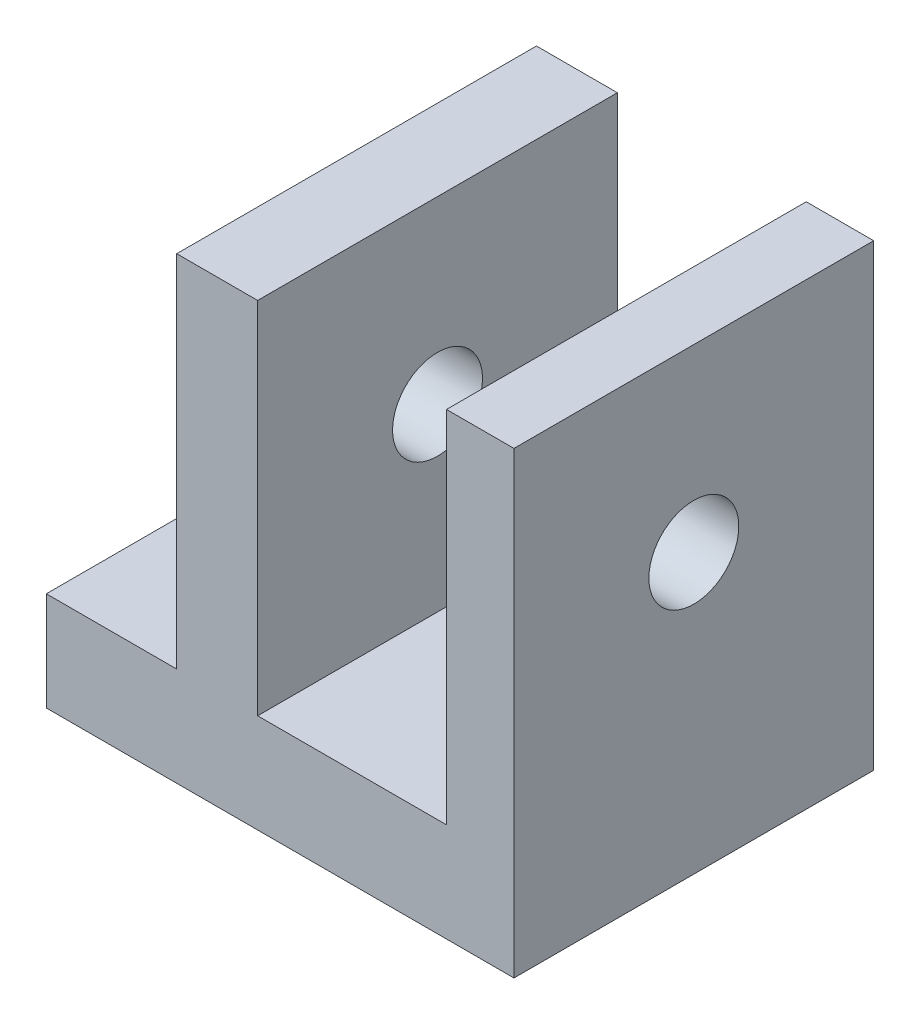
ISO-10303-21;
HEADER;
FILE_DESCRIPTION(('STEP AP214'),'2;1');
FILE_NAME('part.step','',(''),(''),'','','');
FILE_SCHEMA(('AUTOMOTIVE_DESIGN { 1 0 10303 214 1 1 1 1 }'));
ENDSEC;
DATA;
#1=APPLICATION_CONTEXT('core data for automotive mechanical design processes');
#2=APPLICATION_PROTOCOL_DEFINITION('international standard','automotive_design',2000,#1);
#3=PRODUCT_CONTEXT('',#1,'mechanical');
#4=PRODUCT('Part','Part','',(#3));
#5=PRODUCT_RELATED_PRODUCT_CATEGORY('part','',(#4));
#6=PRODUCT_DEFINITION_FORMATION('','',#4);
#7=PRODUCT_DEFINITION_CONTEXT('part definition',#1,'design');
#8=PRODUCT_DEFINITION('design','',#6,#7);
#9=PRODUCT_DEFINITION_SHAPE('','',#8);
#10=(LENGTH_UNIT() NAMED_UNIT(*) SI_UNIT(.MILLI.,.METRE.));
#11=(NAMED_UNIT(*) PLANE_ANGLE_UNIT() SI_UNIT($,.RADIAN.));
#12=(NAMED_UNIT(*) SI_UNIT($,.STERADIAN.) SOLID_ANGLE_UNIT());
#13=UNCERTAINTY_MEASURE_WITH_UNIT(LENGTH_MEASURE(1.E-05),#10,'distance_accuracy_value','');
#14=(GEOMETRIC_REPRESENTATION_CONTEXT(3) GLOBAL_UNCERTAINTY_ASSIGNED_CONTEXT((#13)) GLOBAL_UNIT_ASSIGNED_CONTEXT((#10,
#11,#12)) REPRESENTATION_CONTEXT('',''));
#15=CARTESIAN_POINT('',(0.,0.,0.));
#16=DIRECTION('',(0.,0.,1.));
#17=DIRECTION('',(1.,0.,0.));
#18=AXIS2_PLACEMENT_3D('',#15,#16,#17);
#19=CARTESIAN_POINT('',(0.,0.,-10.));
#20=DIRECTION('',(0.,0.,1.));
#21=DIRECTION('',(1.,0.,0.));
#22=AXIS2_PLACEMENT_3D('',#19,#20,#21);
#23=PLANE('',#22);
#24=DIRECTION('',(-1.,0.,0.));
#25=VECTOR('',#24,1.);
#26=CARTESIAN_POINT('',(0.,24.25,-10.));
#27=LINE('',#26,#25);
#28=CARTESIAN_POINT('',(13.,24.25,-10.));
#29=VERTEX_POINT('',#28);
#30=CARTESIAN_POINT('',(9.25,24.25,-10.));
#31=VERTEX_POINT('',#30);
#32=EDGE_CURVE('E506',#29,#31,#27,.T.);
#33=ORIENTED_EDGE('',*,*,#32,.F.);
#34=DIRECTION('',(0.,1.,0.));
#35=VECTOR('',#34,1.);
#36=CARTESIAN_POINT('',(13.,0.,-10.));
#37=LINE('',#36,#35);
#38=CARTESIAN_POINT('',(13.,-1.25,-10.));
#39=VERTEX_POINT('',#38);
#40=EDGE_CURVE('E452',#39,#29,#37,.T.);
#41=ORIENTED_EDGE('',*,*,#40,.F.);
#42=DIRECTION('',(1.,0.,0.));
#43=VECTOR('',#42,1.);
#44=CARTESIAN_POINT('',(0.,-1.25,-10.));
#45=LINE('',#44,#43);
#46=CARTESIAN_POINT('',(-13.,-1.25,-10.));
#47=VERTEX_POINT('',#46);
#48=EDGE_CURVE('E446',#47,#39,#45,.T.);
#49=ORIENTED_EDGE('',*,*,#48,.F.);
#50=DIRECTION('',(0.,1.,0.));
#51=VECTOR('',#50,1.);
#52=CARTESIAN_POINT('',(-13.,0.,-10.));
#53=LINE('',#52,#51);
#54=CARTESIAN_POINT('',(-13.,4.25,-10.));
#55=VERTEX_POINT('',#54);
#56=EDGE_CURVE('E487',#47,#55,#53,.T.);
#57=ORIENTED_EDGE('',*,*,#56,.T.);
#58=DIRECTION('',(1.,0.,0.));
#59=VECTOR('',#58,1.);
#60=CARTESIAN_POINT('',(0.,4.25,-10.));
#61=LINE('',#60,#59);
#62=CARTESIAN_POINT('',(-5.75,4.25,-10.));
#63=VERTEX_POINT('',#62);
#64=EDGE_CURVE('E525',#55,#63,#61,.T.);
#65=ORIENTED_EDGE('',*,*,#64,.T.);
#66=DIRECTION('',(0.,1.,0.));
#67=VECTOR('',#66,1.);
#68=CARTESIAN_POINT('',(-5.75,0.,-10.));
#69=LINE('',#68,#67);
#70=CARTESIAN_POINT('',(-5.75,24.25,-10.));
#71=VERTEX_POINT('',#70);
#72=EDGE_CURVE('E522',#63,#71,#69,.T.);
#73=ORIENTED_EDGE('',*,*,#72,.T.);
#74=DIRECTION('',(1.,0.,0.));
#75=VECTOR('',#74,1.);
#76=CARTESIAN_POINT('',(0.,24.25,-10.));
#77=LINE('',#76,#75);
#78=CARTESIAN_POINT('',(-1.25,24.25,-10.));
#79=VERTEX_POINT('',#78);
#80=EDGE_CURVE('E519',#71,#79,#77,.T.);
#81=ORIENTED_EDGE('',*,*,#80,.T.);
#82=DIRECTION('',(0.,-1.,0.));
#83=VECTOR('',#82,1.);
#84=CARTESIAN_POINT('',(-1.24999999999999,0.,-10.));
#85=LINE('',#84,#83);
#86=CARTESIAN_POINT('',(-1.25,4.25,-10.));
#87=VERTEX_POINT('',#86);
#88=EDGE_CURVE('E516',#79,#87,#85,.T.);
#89=ORIENTED_EDGE('',*,*,#88,.T.);
#90=DIRECTION('',(1.,0.,0.));
#91=VECTOR('',#90,1.);
#92=CARTESIAN_POINT('',(0.,4.25,-10.));
#93=LINE('',#92,#91);
#94=CARTESIAN_POINT('',(9.25000000000001,4.25,-10.));
#95=VERTEX_POINT('',#94);
#96=EDGE_CURVE('E513',#87,#95,#93,.T.);
#97=ORIENTED_EDGE('',*,*,#96,.T.);
#98=DIRECTION('',(0.,-1.,0.));
#99=VECTOR('',#98,1.);
#100=CARTESIAN_POINT('',(9.25000000000001,0.,-10.));
#101=LINE('',#100,#99);
#102=EDGE_CURVE('E509',#31,#95,#101,.T.);
#103=ORIENTED_EDGE('',*,*,#102,.F.);
#104=EDGE_LOOP('',(#33,#41,#49,#57,#65,#73,#81,#89,#97,#103));
#105=FACE_BOUND('',#104,.T.);
#106=ADVANCED_FACE('F395',(#105),#23,.F.);
#107=CARTESIAN_POINT('',(9.25000000000001,0.,10.));
#108=DIRECTION('',(1.,0.,0.));
#109=DIRECTION('',(0.,1.,0.));
#110=AXIS2_PLACEMENT_3D('',#107,#108,#109);
#111=PLANE('',#110);
#112=CARTESIAN_POINT('',(9.25,14.25,0.));
#113=DIRECTION('',(1.,0.,0.));
#114=DIRECTION('',(0.,1.,0.));
#115=AXIS2_PLACEMENT_3D('',#112,#113,#114);
#116=CIRCLE('',#115,2.5);
#117=CARTESIAN_POINT('',(9.25,14.25,2.5));
#118=VERTEX_POINT('',#117);
#119=EDGE_CURVE('E717',#118,#118,#116,.T.);
#120=ORIENTED_EDGE('',*,*,#119,.T.);
#121=EDGE_LOOP('',(#120));
#122=FACE_BOUND('',#121,.T.);
#123=ORIENTED_EDGE('',*,*,#102,.T.);
#124=DIRECTION('',(0.,0.,-1.));
#125=VECTOR('',#124,1.);
#126=CARTESIAN_POINT('',(9.25000000000001,4.25,10.));
#127=LINE('',#126,#125);
#128=CARTESIAN_POINT('',(9.25000000000001,4.25,10.));
#129=VERTEX_POINT('',#128);
#130=EDGE_CURVE('E404',#129,#95,#127,.T.);
#131=ORIENTED_EDGE('',*,*,#130,.F.);
#132=DIRECTION('',(0.,-1.,0.));
#133=VECTOR('',#132,1.);
#134=CARTESIAN_POINT('',(9.25000000000001,0.,10.));
#135=LINE('',#134,#133);
#136=CARTESIAN_POINT('',(9.25,24.25,10.));
#137=VERTEX_POINT('',#136);
#138=EDGE_CURVE('E460',#137,#129,#135,.T.);
#139=ORIENTED_EDGE('',*,*,#138,.F.);
#140=DIRECTION('',(0.,0.,-1.));
#141=VECTOR('',#140,1.);
#142=CARTESIAN_POINT('',(9.25,24.25,10.));
#143=LINE('',#142,#141);
#144=EDGE_CURVE('E12',#137,#31,#143,.T.);
#145=ORIENTED_EDGE('',*,*,#144,.T.);
#146=EDGE_LOOP('',(#123,#131,#139,#145));
#147=FACE_BOUND('',#146,.T.);
#148=ADVANCED_FACE('F548',(#122,#147),#111,.F.);
#149=CARTESIAN_POINT('',(0.,4.25,10.));
#150=DIRECTION('',(0.,1.,0.));
#151=DIRECTION('',(-1.,0.,0.));
#152=AXIS2_PLACEMENT_3D('',#149,#150,#151);
#153=PLANE('',#152);
#154=ORIENTED_EDGE('',*,*,#96,.F.);
#155=DIRECTION('',(0.,0.,-1.));
#156=VECTOR('',#155,1.);
#157=CARTESIAN_POINT('',(-1.25,4.25,10.));
#158=LINE('',#157,#156);
#159=CARTESIAN_POINT('',(-1.25,4.25,10.));
#160=VERTEX_POINT('',#159);
#161=EDGE_CURVE('E541',#160,#87,#158,.T.);
#162=ORIENTED_EDGE('',*,*,#161,.F.);
#163=DIRECTION('',(1.,0.,0.));
#164=VECTOR('',#163,1.);
#165=CARTESIAN_POINT('',(0.,4.25,10.));
#166=LINE('',#165,#164);
#167=EDGE_CURVE('E547',#160,#129,#166,.T.);
#168=ORIENTED_EDGE('',*,*,#167,.T.);
#169=ORIENTED_EDGE('',*,*,#130,.T.);
#170=EDGE_LOOP('',(#154,#162,#168,#169));
#171=FACE_BOUND('',#170,.T.);
#172=ADVANCED_FACE('F545',(#171),#153,.T.);
#173=CARTESIAN_POINT('',(-1.24999999999999,0.,10.));
#174=DIRECTION('',(1.,0.,0.));
#175=DIRECTION('',(0.,1.,0.));
#176=AXIS2_PLACEMENT_3D('',#173,#174,#175);
#177=PLANE('',#176);
#178=CARTESIAN_POINT('',(-1.25,14.25,0.));
#179=DIRECTION('',(1.,0.,0.));
#180=DIRECTION('',(0.,1.,0.));
#181=AXIS2_PLACEMENT_3D('',#178,#179,#180);
#182=CIRCLE('',#181,2.5);
#183=CARTESIAN_POINT('',(-1.25,14.25,2.5));
#184=VERTEX_POINT('',#183);
#185=EDGE_CURVE('E707',#184,#184,#182,.T.);
#186=ORIENTED_EDGE('',*,*,#185,.F.);
#187=EDGE_LOOP('',(#186));
#188=FACE_BOUND('',#187,.T.);
#189=ORIENTED_EDGE('',*,*,#88,.F.);
#190=DIRECTION('',(0.,0.,-1.));
#191=VECTOR('',#190,1.);
#192=CARTESIAN_POINT('',(-1.25,24.25,10.));
#193=LINE('',#192,#191);
#194=CARTESIAN_POINT('',(-1.25,24.25,10.));
#195=VERTEX_POINT('',#194);
#196=EDGE_CURVE('E539',#195,#79,#193,.T.);
#197=ORIENTED_EDGE('',*,*,#196,.F.);
#198=DIRECTION('',(0.,-1.,0.));
#199=VECTOR('',#198,1.);
#200=CARTESIAN_POINT('',(-1.24999999999999,0.,10.));
#201=LINE('',#200,#199);
#202=EDGE_CURVE('E558',#195,#160,#201,.T.);
#203=ORIENTED_EDGE('',*,*,#202,.T.);
#204=ORIENTED_EDGE('',*,*,#161,.T.);
#205=EDGE_LOOP('',(#189,#197,#203,#204));
#206=FACE_BOUND('',#205,.T.);
#207=ADVANCED_FACE('F555',(#188,#206),#177,.T.);
#208=CARTESIAN_POINT('',(0.,24.25,10.));
#209=DIRECTION('',(0.,1.,0.));
#210=DIRECTION('',(0.,0.,1.));
#211=AXIS2_PLACEMENT_3D('',#208,#209,#210);
#212=PLANE('',#211);
#213=ORIENTED_EDGE('',*,*,#80,.F.);
#214=DIRECTION('',(0.,0.,-1.));
#215=VECTOR('',#214,1.);
#216=CARTESIAN_POINT('',(-5.75,24.25,10.));
#217=LINE('',#216,#215);
#218=CARTESIAN_POINT('',(-5.75,24.25,10.));
#219=VERTEX_POINT('',#218);
#220=EDGE_CURVE('E537',#219,#71,#217,.T.);
#221=ORIENTED_EDGE('',*,*,#220,.F.);
#222=DIRECTION('',(1.,0.,0.));
#223=VECTOR('',#222,1.);
#224=CARTESIAN_POINT('',(0.,24.25,10.));
#225=LINE('',#224,#223);
#226=EDGE_CURVE('E562',#219,#195,#225,.T.);
#227=ORIENTED_EDGE('',*,*,#226,.T.);
#228=ORIENTED_EDGE('',*,*,#196,.T.);
#229=EDGE_LOOP('',(#213,#221,#227,#228));
#230=FACE_BOUND('',#229,.T.);
#231=ADVANCED_FACE('F610',(#230),#212,.T.);
#232=CARTESIAN_POINT('',(-5.75,0.,10.));
#233=DIRECTION('',(-1.,0.,0.));
#234=DIRECTION('',(0.,0.,1.));
#235=AXIS2_PLACEMENT_3D('',#232,#233,#234);
#236=PLANE('',#235);
#237=CARTESIAN_POINT('',(-5.75,14.25,0.));
#238=DIRECTION('',(-1.,0.,0.));
#239=DIRECTION('',(0.,0.,1.));
#240=AXIS2_PLACEMENT_3D('',#237,#238,#239);
#241=CIRCLE('',#240,2.5);
#242=CARTESIAN_POINT('',(-5.74999999999999,14.25,2.5));
#243=VERTEX_POINT('',#242);
#244=EDGE_CURVE('E710',#243,#243,#241,.T.);
#245=ORIENTED_EDGE('',*,*,#244,.F.);
#246=EDGE_LOOP('',(#245));
#247=FACE_BOUND('',#246,.T.);
#248=ORIENTED_EDGE('',*,*,#72,.F.);
#249=DIRECTION('',(0.,0.,-1.));
#250=VECTOR('',#249,1.);
#251=CARTESIAN_POINT('',(-5.75,4.25,10.));
#252=LINE('',#251,#250);
#253=CARTESIAN_POINT('',(-5.75,4.25,10.));
#254=VERTEX_POINT('',#253);
#255=EDGE_CURVE('E535',#254,#63,#252,.T.);
#256=ORIENTED_EDGE('',*,*,#255,.F.);
#257=DIRECTION('',(0.,1.,0.));
#258=VECTOR('',#257,1.);
#259=CARTESIAN_POINT('',(-5.75,0.,10.));
#260=LINE('',#259,#258);
#261=EDGE_CURVE('E500',#254,#219,#260,.T.);
#262=ORIENTED_EDGE('',*,*,#261,.T.);
#263=ORIENTED_EDGE('',*,*,#220,.T.);
#264=EDGE_LOOP('',(#248,#256,#262,#263));
#265=FACE_BOUND('',#264,.T.);
#266=ADVANCED_FACE('F570',(#247,#265),#236,.T.);
#267=CARTESIAN_POINT('',(0.,4.25,10.));
#268=DIRECTION('',(0.,1.,0.));
#269=DIRECTION('',(-1.,0.,0.));
#270=AXIS2_PLACEMENT_3D('',#267,#268,#269);
#271=PLANE('',#270);
#272=CARTESIAN_POINT('',(-9.,4.25,3.));
#273=DIRECTION('',(0.,1.,0.));
#274=DIRECTION('',(-1.,0.,0.));
#275=AXIS2_PLACEMENT_3D('',#272,#273,#274);
#276=CIRCLE('',#275,1.69999999999999);
#277=CARTESIAN_POINT('',(-10.7,4.25,3.));
#278=VERTEX_POINT('',#277);
#279=EDGE_CURVE('E722',#278,#278,#276,.T.);
#280=ORIENTED_EDGE('',*,*,#279,.F.);
#281=EDGE_LOOP('',(#280));
#282=FACE_BOUND('',#281,.T.);
#283=CARTESIAN_POINT('',(-9.,4.25,-3.));
#284=DIRECTION('',(0.,1.,0.));
#285=DIRECTION('',(-1.,0.,0.));
#286=AXIS2_PLACEMENT_3D('',#283,#284,#285);
#287=CIRCLE('',#286,1.69999999999999);
#288=CARTESIAN_POINT('',(-10.7,4.25,-3.));
#289=VERTEX_POINT('',#288);
#290=EDGE_CURVE('E510',#289,#289,#287,.T.);
#291=ORIENTED_EDGE('',*,*,#290,.F.);
#292=EDGE_LOOP('',(#291));
#293=FACE_BOUND('',#292,.T.);
#294=ORIENTED_EDGE('',*,*,#64,.F.);
#295=DIRECTION('',(0.,0.,-1.));
#296=VECTOR('',#295,1.);
#297=CARTESIAN_POINT('',(-13.,4.25,10.));
#298=LINE('',#297,#296);
#299=CARTESIAN_POINT('',(-13.,4.25,10.));
#300=VERTEX_POINT('',#299);
#301=EDGE_CURVE('E488',#300,#55,#298,.T.);
#302=ORIENTED_EDGE('',*,*,#301,.F.);
#303=DIRECTION('',(1.,0.,0.));
#304=VECTOR('',#303,1.);
#305=CARTESIAN_POINT('',(0.,4.25,10.));
#306=LINE('',#305,#304);
#307=EDGE_CURVE('E498',#300,#254,#306,.T.);
#308=ORIENTED_EDGE('',*,*,#307,.T.);
#309=ORIENTED_EDGE('',*,*,#255,.T.);
#310=EDGE_LOOP('',(#294,#302,#308,#309));
#311=FACE_BOUND('',#310,.T.);
#312=ADVANCED_FACE('F573',(#282,#293,#311),#271,.T.);
#313=CARTESIAN_POINT('',(-13.,0.,10.));
#314=DIRECTION('',(-1.,0.,0.));
#315=DIRECTION('',(0.,-1.,0.));
#316=AXIS2_PLACEMENT_3D('',#313,#314,#315);
#317=PLANE('',#316);
#318=ORIENTED_EDGE('',*,*,#56,.F.);
#319=DIRECTION('',(0.,0.,-1.));
#320=VECTOR('',#319,1.);
#321=CARTESIAN_POINT('',(-13.,-1.25,10.));
#322=LINE('',#321,#320);
#323=CARTESIAN_POINT('',(-13.,-1.25,10.));
#324=VERTEX_POINT('',#323);
#325=EDGE_CURVE('E481',#324,#47,#322,.T.);
#326=ORIENTED_EDGE('',*,*,#325,.F.);
#327=DIRECTION('',(0.,1.,0.));
#328=VECTOR('',#327,1.);
#329=CARTESIAN_POINT('',(-13.,0.,10.));
#330=LINE('',#329,#328);
#331=EDGE_CURVE('E485',#324,#300,#330,.T.);
#332=ORIENTED_EDGE('',*,*,#331,.T.);
#333=ORIENTED_EDGE('',*,*,#301,.T.);
#334=EDGE_LOOP('',(#318,#326,#332,#333));
#335=FACE_BOUND('',#334,.T.);
#336=ADVANCED_FACE('F483',(#335),#317,.T.);
#337=CARTESIAN_POINT('',(0.,-1.25,10.));
#338=DIRECTION('',(0.,1.,0.));
#339=DIRECTION('',(0.,0.,1.));
#340=AXIS2_PLACEMENT_3D('',#337,#338,#339);
#341=PLANE('',#340);
#342=CARTESIAN_POINT('',(-9.,-1.25,3.));
#343=DIRECTION('',(0.,-1.,0.));
#344=DIRECTION('',(0.,0.,-1.));
#345=AXIS2_PLACEMENT_3D('',#342,#343,#344);
#346=CIRCLE('',#345,1.69999999999999);
#347=CARTESIAN_POINT('',(-9.,-1.25,1.30000000000001));
#348=VERTEX_POINT('',#347);
#349=EDGE_CURVE('E719',#348,#348,#346,.T.);
#350=ORIENTED_EDGE('',*,*,#349,.F.);
#351=EDGE_LOOP('',(#350));
#352=FACE_BOUND('',#351,.T.);
#353=CARTESIAN_POINT('',(-9.,-1.25,-3.));
#354=DIRECTION('',(0.,-1.,0.));
#355=DIRECTION('',(0.,0.,-1.));
#356=AXIS2_PLACEMENT_3D('',#353,#354,#355);
#357=CIRCLE('',#356,1.69999999999999);
#358=CARTESIAN_POINT('',(-9.,-1.25,-4.69999999999999));
#359=VERTEX_POINT('',#358);
#360=EDGE_CURVE('E725',#359,#359,#357,.T.);
#361=ORIENTED_EDGE('',*,*,#360,.F.);
#362=EDGE_LOOP('',(#361));
#363=FACE_BOUND('',#362,.T.);
#364=ORIENTED_EDGE('',*,*,#48,.T.);
#365=DIRECTION('',(0.,0.,-1.));
#366=VECTOR('',#365,1.);
#367=CARTESIAN_POINT('',(13.,-1.25,10.));
#368=LINE('',#367,#366);
#369=CARTESIAN_POINT('',(13.,-1.25,10.));
#370=VERTEX_POINT('',#369);
#371=EDGE_CURVE('E489',#370,#39,#368,.T.);
#372=ORIENTED_EDGE('',*,*,#371,.F.);
#373=DIRECTION('',(1.,0.,0.));
#374=VECTOR('',#373,1.);
#375=CARTESIAN_POINT('',(0.,-1.25,10.));
#376=LINE('',#375,#374);
#377=EDGE_CURVE('E491',#324,#370,#376,.T.);
#378=ORIENTED_EDGE('',*,*,#377,.F.);
#379=ORIENTED_EDGE('',*,*,#325,.T.);
#380=EDGE_LOOP('',(#364,#372,#378,#379));
#381=FACE_BOUND('',#380,.T.);
#382=ADVANCED_FACE('F492',(#352,#363,#381),#341,.F.);
#383=CARTESIAN_POINT('',(13.,0.,10.));
#384=DIRECTION('',(-1.,0.,0.));
#385=DIRECTION('',(0.,0.,1.));
#386=AXIS2_PLACEMENT_3D('',#383,#384,#385);
#387=PLANE('',#386);
#388=CARTESIAN_POINT('',(13.,14.25,0.));
#389=DIRECTION('',(-1.,0.,0.));
#390=DIRECTION('',(0.,0.,1.));
#391=AXIS2_PLACEMENT_3D('',#388,#389,#390);
#392=CIRCLE('',#391,2.5);
#393=CARTESIAN_POINT('',(13.,14.25,2.5));
#394=VERTEX_POINT('',#393);
#395=EDGE_CURVE('E711',#394,#394,#392,.F.);
#396=ORIENTED_EDGE('',*,*,#395,.F.);
#397=EDGE_LOOP('',(#396));
#398=FACE_BOUND('',#397,.T.);
#399=ORIENTED_EDGE('',*,*,#40,.T.);
#400=DIRECTION('',(0.,0.,-1.));
#401=VECTOR('',#400,1.);
#402=CARTESIAN_POINT('',(13.,24.25,10.));
#403=LINE('',#402,#401);
#404=CARTESIAN_POINT('',(13.,24.25,10.));
#405=VERTEX_POINT('',#404);
#406=EDGE_CURVE('E505',#405,#29,#403,.T.);
#407=ORIENTED_EDGE('',*,*,#406,.F.);
#408=DIRECTION('',(0.,1.,0.));
#409=VECTOR('',#408,1.);
#410=CARTESIAN_POINT('',(13.,0.,10.));
#411=LINE('',#410,#409);
#412=EDGE_CURVE('E412',#370,#405,#411,.T.);
#413=ORIENTED_EDGE('',*,*,#412,.F.);
#414=ORIENTED_EDGE('',*,*,#371,.T.);
#415=EDGE_LOOP('',(#399,#407,#413,#414));
#416=FACE_BOUND('',#415,.T.);
#417=ADVANCED_FACE('F576',(#398,#416),#387,.F.);
#418=CARTESIAN_POINT('',(0.,24.25,10.));
#419=DIRECTION('',(0.,-1.,0.));
#420=DIRECTION('',(0.,0.,-1.));
#421=AXIS2_PLACEMENT_3D('',#418,#419,#420);
#422=PLANE('',#421);
#423=ORIENTED_EDGE('',*,*,#32,.T.);
#424=ORIENTED_EDGE('',*,*,#144,.F.);
#425=DIRECTION('',(-1.,0.,0.));
#426=VECTOR('',#425,1.);
#427=CARTESIAN_POINT('',(0.,24.25,10.));
#428=LINE('',#427,#426);
#429=EDGE_CURVE('E531',#405,#137,#428,.T.);
#430=ORIENTED_EDGE('',*,*,#429,.F.);
#431=ORIENTED_EDGE('',*,*,#406,.T.);
#432=EDGE_LOOP('',(#423,#424,#430,#431));
#433=FACE_BOUND('',#432,.T.);
#434=ADVANCED_FACE('F397',(#433),#422,.F.);
#435=CARTESIAN_POINT('',(0.,0.,10.));
#436=DIRECTION('',(0.,0.,1.));
#437=DIRECTION('',(1.,0.,0.));
#438=AXIS2_PLACEMENT_3D('',#435,#436,#437);
#439=PLANE('',#438);
#440=ORIENTED_EDGE('',*,*,#429,.T.);
#441=ORIENTED_EDGE('',*,*,#138,.T.);
#442=ORIENTED_EDGE('',*,*,#167,.F.);
#443=ORIENTED_EDGE('',*,*,#202,.F.);
#444=ORIENTED_EDGE('',*,*,#226,.F.);
#445=ORIENTED_EDGE('',*,*,#261,.F.);
#446=ORIENTED_EDGE('',*,*,#307,.F.);
#447=ORIENTED_EDGE('',*,*,#331,.F.);
#448=ORIENTED_EDGE('',*,*,#377,.T.);
#449=ORIENTED_EDGE('',*,*,#412,.T.);
#450=EDGE_LOOP('',(#440,#441,#442,#443,#444,#445,#446,#447,#448,#449));
#451=FACE_BOUND('',#450,.T.);
#452=ADVANCED_FACE('F495',(#451),#439,.T.);
#453=CARTESIAN_POINT('',(-9.,-1.25,-3.));
#454=DIRECTION('',(0.,-1.,0.));
#455=DIRECTION('',(0.,0.,-1.));
#456=AXIS2_PLACEMENT_3D('',#453,#454,#455);
#457=CYLINDRICAL_SURFACE('',#456,1.69999999999999);
#458=ORIENTED_EDGE('',*,*,#290,.T.);
#459=EDGE_LOOP('',(#458));
#460=FACE_BOUND('',#459,.T.);
#461=ORIENTED_EDGE('',*,*,#360,.T.);
#462=EDGE_LOOP('',(#461));
#463=FACE_BOUND('',#462,.T.);
#464=ADVANCED_FACE('F584',(#460,#463),#457,.F.);
#465=CARTESIAN_POINT('',(-9.,-1.25,3.));
#466=DIRECTION('',(0.,-1.,0.));
#467=DIRECTION('',(0.,0.,-1.));
#468=AXIS2_PLACEMENT_3D('',#465,#466,#467);
#469=CYLINDRICAL_SURFACE('',#468,1.69999999999999);
#470=ORIENTED_EDGE('',*,*,#279,.T.);
#471=EDGE_LOOP('',(#470));
#472=FACE_BOUND('',#471,.T.);
#473=ORIENTED_EDGE('',*,*,#349,.T.);
#474=EDGE_LOOP('',(#473));
#475=FACE_BOUND('',#474,.T.);
#476=ADVANCED_FACE('F594',(#472,#475),#469,.F.);
#477=CARTESIAN_POINT('',(20.0710678118655,14.25,0.));
#478=DIRECTION('',(-1.,0.,0.));
#479=DIRECTION('',(0.,0.,1.));
#480=AXIS2_PLACEMENT_3D('',#477,#478,#479);
#481=CYLINDRICAL_SURFACE('',#480,2.5);
#482=CARTESIAN_POINT('',(13.,14.25,2.5));
#483=CARTESIAN_POINT('',(12.9609375,14.25,2.5));
#484=CARTESIAN_POINT('',(12.921875,14.25,2.5));
#485=CARTESIAN_POINT('',(12.84375,14.25,2.5));
#486=CARTESIAN_POINT('',(12.8046875,14.25,2.5));
#487=CARTESIAN_POINT('',(12.7265625,14.25,2.5));
#488=CARTESIAN_POINT('',(12.6875,14.25,2.5));
#489=CARTESIAN_POINT('',(12.609375,14.25,2.5));
#490=CARTESIAN_POINT('',(12.5703125,14.25,2.5));
#491=CARTESIAN_POINT('',(12.4921875,14.25,2.5));
#492=CARTESIAN_POINT('',(12.453125,14.25,2.5));
#493=CARTESIAN_POINT('',(12.375,14.25,2.5));
#494=CARTESIAN_POINT('',(12.3359375,14.25,2.5));
#495=CARTESIAN_POINT('',(12.2578125,14.25,2.5));
#496=CARTESIAN_POINT('',(12.21875,14.25,2.5));
#497=CARTESIAN_POINT('',(12.140625,14.25,2.5));
#498=CARTESIAN_POINT('',(12.1015625,14.25,2.5));
#499=CARTESIAN_POINT('',(12.0234375,14.25,2.5));
#500=CARTESIAN_POINT('',(11.984375,14.25,2.5));
#501=CARTESIAN_POINT('',(11.90625,14.25,2.5));
#502=CARTESIAN_POINT('',(11.8671875,14.25,2.5));
#503=CARTESIAN_POINT('',(11.7890625,14.25,2.5));
#504=CARTESIAN_POINT('',(11.75,14.25,2.5));
#505=CARTESIAN_POINT('',(11.671875,14.25,2.5));
#506=CARTESIAN_POINT('',(11.6328125,14.25,2.5));
#507=CARTESIAN_POINT('',(11.5546875,14.25,2.5));
#508=CARTESIAN_POINT('',(11.515625,14.25,2.5));
#509=CARTESIAN_POINT('',(11.4375,14.25,2.5));
#510=CARTESIAN_POINT('',(11.3984375,14.25,2.5));
#511=CARTESIAN_POINT('',(11.3203125,14.25,2.5));
#512=CARTESIAN_POINT('',(11.28125,14.25,2.5));
#513=CARTESIAN_POINT('',(11.203125,14.25,2.5));
#514=CARTESIAN_POINT('',(11.1640625,14.25,2.5));
#515=CARTESIAN_POINT('',(11.0859375,14.25,2.5));
#516=CARTESIAN_POINT('',(11.046875,14.25,2.5));
#517=CARTESIAN_POINT('',(10.96875,14.25,2.5));
#518=CARTESIAN_POINT('',(10.9296875,14.25,2.5));
#519=CARTESIAN_POINT('',(10.8515625,14.25,2.5));
#520=CARTESIAN_POINT('',(10.8125,14.25,2.5));
#521=CARTESIAN_POINT('',(10.734375,14.25,2.5));
#522=CARTESIAN_POINT('',(10.6953125,14.25,2.5));
#523=CARTESIAN_POINT('',(10.6171875,14.25,2.5));
#524=CARTESIAN_POINT('',(10.578125,14.25,2.5));
#525=CARTESIAN_POINT('',(10.5,14.25,2.5));
#526=CARTESIAN_POINT('',(10.4609375,14.25,2.5));
#527=CARTESIAN_POINT('',(10.3828125,14.25,2.5));
#528=CARTESIAN_POINT('',(10.34375,14.25,2.5));
#529=CARTESIAN_POINT('',(10.265625,14.25,2.5));
#530=CARTESIAN_POINT('',(10.2265625,14.25,2.5));
#531=CARTESIAN_POINT('',(10.1484375,14.25,2.5));
#532=CARTESIAN_POINT('',(10.109375,14.25,2.5));
#533=CARTESIAN_POINT('',(10.03125,14.25,2.5));
#534=CARTESIAN_POINT('',(9.9921875,14.25,2.5));
#535=CARTESIAN_POINT('',(9.9140625,14.25,2.5));
#536=CARTESIAN_POINT('',(9.875,14.25,2.5));
#537=CARTESIAN_POINT('',(9.796875,14.25,2.5));
#538=CARTESIAN_POINT('',(9.7578125,14.25,2.5));
#539=CARTESIAN_POINT('',(9.6796875,14.25,2.5));
#540=CARTESIAN_POINT('',(9.640625,14.25,2.5));
#541=CARTESIAN_POINT('',(9.5625,14.25,2.5));
#542=CARTESIAN_POINT('',(9.5234375,14.25,2.5));
#543=CARTESIAN_POINT('',(9.4453125,14.25,2.5));
#544=CARTESIAN_POINT('',(9.40625,14.25,2.5));
#545=CARTESIAN_POINT('',(9.328125,14.25,2.5));
#546=CARTESIAN_POINT('',(9.2890625,14.25,2.5));
#547=CARTESIAN_POINT('',(9.25,14.25,2.5));
#548=B_SPLINE_CURVE_WITH_KNOTS('',3,(#482,#483,#484,#485,#486,#487,#488,#489,#490,#491,#492,
#493,#494,#495,#496,#497,#498,#499,#500,#501,#502,#503,#504,#505,#506,#507,#508,#509,#510,#511,
#512,#513,#514,#515,#516,#517,#518,#519,#520,#521,#522,#523,#524,#525,#526,#527,#528,#529,#530,
#531,#532,#533,#534,#535,#536,#537,#538,#539,#540,#541,#542,#543,#544,#545,#546,#547),
.UNSPECIFIED.,.F.,.F.,(4,2,2,2,2,2,2,2,2,2,2,2,2,2,2,2,2,2,2,2,2,2,2,2,2,2,2,2,2,2,2,2,4),(0.,
0.117187500000001,0.234375000000002,0.351562499999999,0.46875,0.585937500000001,
0.703125000000001,0.8203125,0.937499999999999,1.0546875,1.171875,1.2890625,1.40625,1.5234375,
1.640625,1.7578125,1.875,1.9921875,2.109375,2.2265625,2.34375,2.4609375,2.578125,2.6953125,
2.8125,2.9296875,3.046875,3.1640625,3.28125,3.3984375,3.515625,3.6328125,3.75),.UNSPECIFIED.);
#549=EDGE_CURVE('BSEAM653',#394,#118,#548,.T.);
#550=ORIENTED_EDGE('',*,*,#395,.T.);
#551=ORIENTED_EDGE('',*,*,#119,.F.);
#552=ORIENTED_EDGE('',*,*,#549,.T.);
#553=ORIENTED_EDGE('',*,*,#549,.F.);
#554=EDGE_LOOP('',(#550,#552,#551,#553));
#555=FACE_BOUND('',#554,.T.);
#556=ADVANCED_FACE('F653',(#555),#481,.F.);
#557=CARTESIAN_POINT('',(-1.25,14.25,2.5));
#558=CARTESIAN_POINT('',(-1.296875,14.25,2.5));
#559=CARTESIAN_POINT('',(-1.34375,14.25,2.5));
#560=CARTESIAN_POINT('',(-1.4375,14.25,2.5));
#561=CARTESIAN_POINT('',(-1.484375,14.25,2.5));
#562=CARTESIAN_POINT('',(-1.578125,14.25,2.5));
#563=CARTESIAN_POINT('',(-1.625,14.25,2.5));
#564=CARTESIAN_POINT('',(-1.71875,14.25,2.5));
#565=CARTESIAN_POINT('',(-1.765625,14.25,2.5));
#566=CARTESIAN_POINT('',(-1.859375,14.25,2.5));
#567=CARTESIAN_POINT('',(-1.90625,14.25,2.5));
#568=CARTESIAN_POINT('',(-2.,14.25,2.5));
#569=CARTESIAN_POINT('',(-2.046875,14.25,2.5));
#570=CARTESIAN_POINT('',(-2.140625,14.25,2.5));
#571=CARTESIAN_POINT('',(-2.1875,14.25,2.5));
#572=CARTESIAN_POINT('',(-2.28125,14.25,2.5));
#573=CARTESIAN_POINT('',(-2.328125,14.25,2.5));
#574=CARTESIAN_POINT('',(-2.421875,14.25,2.5));
#575=CARTESIAN_POINT('',(-2.46875,14.25,2.5));
#576=CARTESIAN_POINT('',(-2.5625,14.25,2.5));
#577=CARTESIAN_POINT('',(-2.609375,14.25,2.5));
#578=CARTESIAN_POINT('',(-2.703125,14.25,2.5));
#579=CARTESIAN_POINT('',(-2.75,14.25,2.5));
#580=CARTESIAN_POINT('',(-2.84375,14.25,2.5));
#581=CARTESIAN_POINT('',(-2.890625,14.25,2.5));
#582=CARTESIAN_POINT('',(-2.984375,14.25,2.5));
#583=CARTESIAN_POINT('',(-3.03125,14.25,2.5));
#584=CARTESIAN_POINT('',(-3.125,14.25,2.5));
#585=CARTESIAN_POINT('',(-3.171875,14.25,2.5));
#586=CARTESIAN_POINT('',(-3.265625,14.25,2.5));
#587=CARTESIAN_POINT('',(-3.31249999999999,14.25,2.5));
#588=CARTESIAN_POINT('',(-3.40624999999999,14.25,2.5));
#589=CARTESIAN_POINT('',(-3.453125,14.25,2.5));
#590=CARTESIAN_POINT('',(-3.546875,14.25,2.5));
#591=CARTESIAN_POINT('',(-3.59375,14.25,2.5));
#592=CARTESIAN_POINT('',(-3.6875,14.25,2.5));
#593=CARTESIAN_POINT('',(-3.734375,14.25,2.5));
#594=CARTESIAN_POINT('',(-3.828125,14.25,2.5));
#595=CARTESIAN_POINT('',(-3.875,14.25,2.5));
#596=CARTESIAN_POINT('',(-3.96875,14.25,2.5));
#597=CARTESIAN_POINT('',(-4.015625,14.25,2.5));
#598=CARTESIAN_POINT('',(-4.109375,14.25,2.5));
#599=CARTESIAN_POINT('',(-4.15625,14.25,2.5));
#600=CARTESIAN_POINT('',(-4.25,14.25,2.5));
#601=CARTESIAN_POINT('',(-4.296875,14.25,2.5));
#602=CARTESIAN_POINT('',(-4.390625,14.25,2.5));
#603=CARTESIAN_POINT('',(-4.4375,14.25,2.5));
#604=CARTESIAN_POINT('',(-4.53124999999999,14.25,2.5));
#605=CARTESIAN_POINT('',(-4.57812499999999,14.25,2.5));
#606=CARTESIAN_POINT('',(-4.67187499999999,14.25,2.5));
#607=CARTESIAN_POINT('',(-4.71874999999999,14.25,2.5));
#608=CARTESIAN_POINT('',(-4.81249999999999,14.25,2.5));
#609=CARTESIAN_POINT('',(-4.85937499999999,14.25,2.5));
#610=CARTESIAN_POINT('',(-4.95312499999999,14.25,2.5));
#611=CARTESIAN_POINT('',(-4.99999999999999,14.25,2.5));
#612=CARTESIAN_POINT('',(-5.09374999999999,14.25,2.5));
#613=CARTESIAN_POINT('',(-5.14062499999999,14.25,2.5));
#614=CARTESIAN_POINT('',(-5.23437499999999,14.25,2.5));
#615=CARTESIAN_POINT('',(-5.28125,14.25,2.5));
#616=CARTESIAN_POINT('',(-5.375,14.25,2.5));
#617=CARTESIAN_POINT('',(-5.421875,14.25,2.5));
#618=CARTESIAN_POINT('',(-5.515625,14.25,2.5));
#619=CARTESIAN_POINT('',(-5.5625,14.25,2.5));
#620=CARTESIAN_POINT('',(-5.65625,14.25,2.5));
#621=CARTESIAN_POINT('',(-5.703125,14.25,2.5));
#622=CARTESIAN_POINT('',(-5.74999999999999,14.25,2.5));
#623=B_SPLINE_CURVE_WITH_KNOTS('',3,(#557,#558,#559,#560,#561,#562,#563,#564,#565,#566,#567,
#568,#569,#570,#571,#572,#573,#574,#575,#576,#577,#578,#579,#580,#581,#582,#583,#584,#585,#586,
#587,#588,#589,#590,#591,#592,#593,#594,#595,#596,#597,#598,#599,#600,#601,#602,#603,#604,#605,
#606,#607,#608,#609,#610,#611,#612,#613,#614,#615,#616,#617,#618,#619,#620,#621,#622),
.UNSPECIFIED.,.F.,.F.,(4,2,2,2,2,2,2,2,2,2,2,2,2,2,2,2,2,2,2,2,2,2,2,2,2,2,2,2,2,2,2,2,4),(0.,
0.140624999999998,0.28125,0.421874999999999,0.5625,0.703124999999999,0.843750000000001,
0.984374999999999,1.125,1.265625,1.40625,1.546875,1.6875,1.828125,1.96875,2.109375,2.25,
2.390625,2.53125,2.671875,2.8125,2.953125,3.09375,3.234375,3.375,3.515625,3.65625,3.796875,
3.9375,4.078125,4.21875,4.359375,4.5),.UNSPECIFIED.);
#624=EDGE_CURVE('BSEAM691',#184,#243,#623,.T.);
#625=ORIENTED_EDGE('',*,*,#185,.T.);
#626=ORIENTED_EDGE('',*,*,#244,.T.);
#627=ORIENTED_EDGE('',*,*,#624,.T.);
#628=ORIENTED_EDGE('',*,*,#624,.F.);
#629=EDGE_LOOP('',(#625,#627,#626,#628));
#630=FACE_BOUND('',#629,.T.);
#631=ADVANCED_FACE('F691',(#630),#481,.F.);
#632=CLOSED_SHELL('',(#106,#148,#172,#207,#231,#266,#312,#336,#382,#417,#434,#452,#464,#476,
#556,#631));
#633=MANIFOLD_SOLID_BREP('B2',#632);
#634=ADVANCED_BREP_SHAPE_REPRESENTATION('',(#18,#633),#14);
#635=SHAPE_DEFINITION_REPRESENTATION(#9,#634);
ENDSEC;
END-ISO-10303-21;
